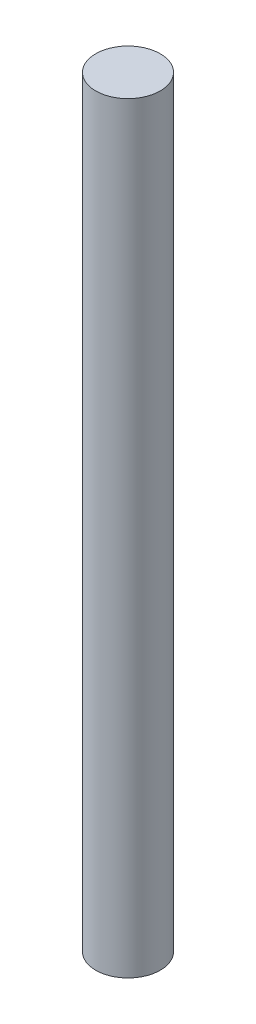
ISO-10303-21;
HEADER;
FILE_DESCRIPTION(('STEP AP214'),'2;1');
FILE_NAME('part.step','',(''),(''),'','','');
FILE_SCHEMA(('AUTOMOTIVE_DESIGN { 1 0 10303 214 1 1 1 1 }'));
ENDSEC;
DATA;
#1=APPLICATION_CONTEXT('core data for automotive mechanical design processes');
#2=APPLICATION_PROTOCOL_DEFINITION('international standard','automotive_design',2000,#1);
#3=PRODUCT_CONTEXT('',#1,'mechanical');
#4=PRODUCT('Part','Part','',(#3));
#5=PRODUCT_RELATED_PRODUCT_CATEGORY('part','',(#4));
#6=PRODUCT_DEFINITION_FORMATION('','',#4);
#7=PRODUCT_DEFINITION_CONTEXT('part definition',#1,'design');
#8=PRODUCT_DEFINITION('design','',#6,#7);
#9=PRODUCT_DEFINITION_SHAPE('','',#8);
#10=(LENGTH_UNIT() NAMED_UNIT(*) SI_UNIT(.MILLI.,.METRE.));
#11=(NAMED_UNIT(*) PLANE_ANGLE_UNIT() SI_UNIT($,.RADIAN.));
#12=(NAMED_UNIT(*) SI_UNIT($,.STERADIAN.) SOLID_ANGLE_UNIT());
#13=UNCERTAINTY_MEASURE_WITH_UNIT(LENGTH_MEASURE(1.E-05),#10,'distance_accuracy_value','');
#14=(GEOMETRIC_REPRESENTATION_CONTEXT(3) GLOBAL_UNCERTAINTY_ASSIGNED_CONTEXT((#13)) GLOBAL_UNIT_ASSIGNED_CONTEXT((#10,
#11,#12)) REPRESENTATION_CONTEXT('',''));
#15=CARTESIAN_POINT('',(0.,0.,0.));
#16=DIRECTION('',(0.,0.,1.));
#17=DIRECTION('',(1.,0.,0.));
#18=AXIS2_PLACEMENT_3D('',#15,#16,#17);
#19=CARTESIAN_POINT('',(0.,150.,0.));
#20=DIRECTION('',(0.,-1.,0.));
#21=DIRECTION('',(0.,0.,-1.));
#22=AXIS2_PLACEMENT_3D('',#19,#20,#21);
#23=CYLINDRICAL_SURFACE('',#22,6.35);
#24=CARTESIAN_POINT('',(0.,150.,0.));
#25=DIRECTION('',(0.,1.,0.));
#26=DIRECTION('',(0.,0.,1.));
#27=AXIS2_PLACEMENT_3D('',#24,#25,#26);
#28=CIRCLE('',#27,6.35);
#29=CARTESIAN_POINT('',(0.,150.,6.35));
#30=VERTEX_POINT('',#29);
#31=EDGE_CURVE('E10',#30,#30,#28,.T.);
#32=ORIENTED_EDGE('',*,*,#31,.F.);
#33=EDGE_LOOP('',(#32));
#34=FACE_BOUND('',#33,.T.);
#35=CARTESIAN_POINT('',(0.,0.,0.));
#36=DIRECTION('',(0.,1.,0.));
#37=DIRECTION('',(0.,0.,1.));
#38=AXIS2_PLACEMENT_3D('',#35,#36,#37);
#39=CIRCLE('',#38,6.35);
#40=CARTESIAN_POINT('',(0.,0.,6.35));
#41=VERTEX_POINT('',#40);
#42=EDGE_CURVE('E34',#41,#41,#39,.T.);
#43=ORIENTED_EDGE('',*,*,#42,.T.);
#44=EDGE_LOOP('',(#43));
#45=FACE_BOUND('',#44,.T.);
#46=ADVANCED_FACE('F31',(#34,#45),#23,.T.);
#47=CARTESIAN_POINT('',(0.,150.,0.));
#48=DIRECTION('',(0.,1.,0.));
#49=DIRECTION('',(0.,0.,1.));
#50=AXIS2_PLACEMENT_3D('',#47,#48,#49);
#51=PLANE('',#50);
#52=ORIENTED_EDGE('',*,*,#31,.T.);
#53=EDGE_LOOP('',(#52));
#54=FACE_BOUND('',#53,.T.);
#55=ADVANCED_FACE('F46',(#54),#51,.T.);
#56=CARTESIAN_POINT('',(0.,0.,0.));
#57=DIRECTION('',(0.,1.,0.));
#58=DIRECTION('',(0.,0.,1.));
#59=AXIS2_PLACEMENT_3D('',#56,#57,#58);
#60=PLANE('',#59);
#61=ORIENTED_EDGE('',*,*,#42,.F.);
#62=EDGE_LOOP('',(#61));
#63=FACE_BOUND('',#62,.T.);
#64=ADVANCED_FACE('F44',(#63),#60,.F.);
#65=CLOSED_SHELL('',(#46,#55,#64));
#66=MANIFOLD_SOLID_BREP('B2',#65);
#67=ADVANCED_BREP_SHAPE_REPRESENTATION('',(#18,#66),#14);
#68=SHAPE_DEFINITION_REPRESENTATION(#9,#67);
ENDSEC;
END-ISO-10303-21;
